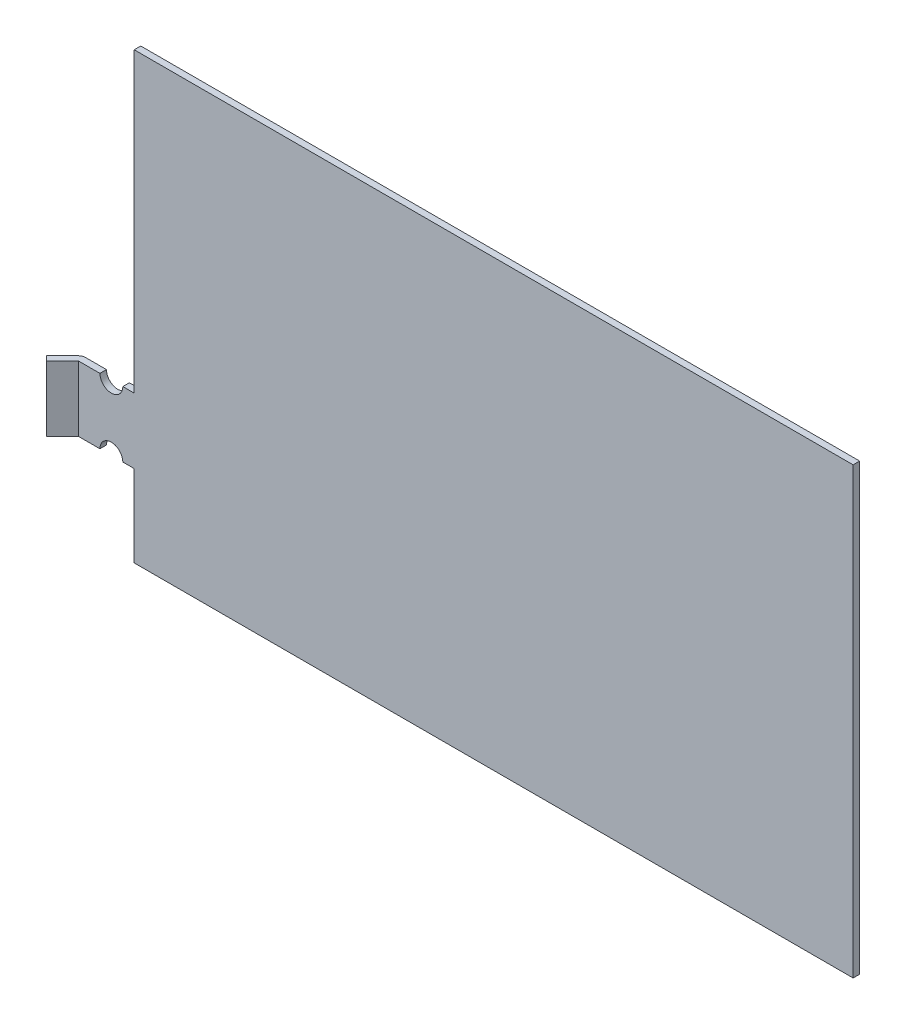
ISO-10303-21;
HEADER;
FILE_DESCRIPTION(('STEP AP214'),'2;1');
FILE_NAME('part.step','',(''),(''),'','','');
FILE_SCHEMA(('AUTOMOTIVE_DESIGN { 1 0 10303 214 1 1 1 1 }'));
ENDSEC;
DATA;
#1=APPLICATION_CONTEXT('core data for automotive mechanical design processes');
#2=APPLICATION_PROTOCOL_DEFINITION('international standard','automotive_design',2000,#1);
#3=PRODUCT_CONTEXT('',#1,'mechanical');
#4=PRODUCT('Part','Part','',(#3));
#5=PRODUCT_RELATED_PRODUCT_CATEGORY('part','',(#4));
#6=PRODUCT_DEFINITION_FORMATION('','',#4);
#7=PRODUCT_DEFINITION_CONTEXT('part definition',#1,'design');
#8=PRODUCT_DEFINITION('design','',#6,#7);
#9=PRODUCT_DEFINITION_SHAPE('','',#8);
#10=(LENGTH_UNIT() NAMED_UNIT(*) SI_UNIT(.MILLI.,.METRE.));
#11=(NAMED_UNIT(*) PLANE_ANGLE_UNIT() SI_UNIT($,.RADIAN.));
#12=(NAMED_UNIT(*) SI_UNIT($,.STERADIAN.) SOLID_ANGLE_UNIT());
#13=UNCERTAINTY_MEASURE_WITH_UNIT(LENGTH_MEASURE(1.E-05),#10,'distance_accuracy_value','');
#14=(GEOMETRIC_REPRESENTATION_CONTEXT(3) GLOBAL_UNCERTAINTY_ASSIGNED_CONTEXT((#13)) GLOBAL_UNIT_ASSIGNED_CONTEXT((#10,
#11,#12)) REPRESENTATION_CONTEXT('',''));
#15=CARTESIAN_POINT('',(0.,0.,0.));
#16=DIRECTION('',(0.,0.,1.));
#17=DIRECTION('',(1.,0.,0.));
#18=AXIS2_PLACEMENT_3D('',#15,#16,#17);
#19=CARTESIAN_POINT('',(-65.2711551112264,-15.,0.));
#20=DIRECTION('',(0.,1.,0.));
#21=DIRECTION('',(-1.,0.,0.));
#22=AXIS2_PLACEMENT_3D('',#19,#20,#21);
#23=PLANE('',#22);
#24=DIRECTION('',(0.,0.,1.));
#25=VECTOR('',#24,1.);
#26=CARTESIAN_POINT('',(-80.5,-15.,-276.873298324553));
#27=LINE('',#26,#25);
#28=CARTESIAN_POINT('',(-80.5,-15.,0.));
#29=VERTEX_POINT('',#28);
#30=CARTESIAN_POINT('',(-80.5,-15.,2.));
#31=VERTEX_POINT('',#30);
#32=EDGE_CURVE('E11',#29,#31,#27,.T.);
#33=ORIENTED_EDGE('',*,*,#32,.F.);
#34=DIRECTION('',(-1.,0.,0.));
#35=VECTOR('',#34,1.);
#36=CARTESIAN_POINT('',(-65.2711551112264,-15.,0.));
#37=LINE('',#36,#35);
#38=CARTESIAN_POINT('',(-86.9991715728753,-15.,0.));
#39=VERTEX_POINT('',#38);
#40=EDGE_CURVE('E225',#29,#39,#37,.T.);
#41=ORIENTED_EDGE('',*,*,#40,.T.);
#42=CARTESIAN_POINT('',(-86.9991715728753,-15.,2.002));
#43=DIRECTION('',(0.,1.,0.));
#44=DIRECTION('',(0.,0.,1.));
#45=AXIS2_PLACEMENT_3D('',#42,#43,#44);
#46=CIRCLE('',#45,2.002);
#47=CARTESIAN_POINT('',(-88.4147993488107,-15.,0.586372224064531));
#48=VERTEX_POINT('',#47);
#49=EDGE_CURVE('E258',#39,#48,#46,.T.);
#50=ORIENTED_EDGE('',*,*,#49,.T.);
#51=DIRECTION('',(0.707106781186548,0.,-0.707106781186548));
#52=VECTOR('',#51,1.);
#53=CARTESIAN_POINT('',(-88.2309750672444,-15.,0.40254794249823));
#54=LINE('',#53,#52);
#55=CARTESIAN_POINT('',(-93.3639610306789,-15.,5.53553390593275));
#56=VERTEX_POINT('',#55);
#57=EDGE_CURVE('E251',#56,#48,#54,.T.);
#58=ORIENTED_EDGE('',*,*,#57,.F.);
#59=DIRECTION('',(0.707106781186548,0.,0.707106781186548));
#60=VECTOR('',#59,1.);
#61=CARTESIAN_POINT('',(-93.3639610306789,-15.,5.53553390593275));
#62=LINE('',#61,#60);
#63=CARTESIAN_POINT('',(-91.9497474683059,-15.,6.94974746830585));
#64=VERTEX_POINT('',#63);
#65=EDGE_CURVE('E236',#56,#64,#62,.T.);
#66=ORIENTED_EDGE('',*,*,#65,.T.);
#67=DIRECTION('',(0.707106781186548,0.,-0.707106781186548));
#68=VECTOR('',#67,1.);
#69=CARTESIAN_POINT('',(-86.8167615048713,-15.,1.81676150487133));
#70=LINE('',#69,#68);
#71=CARTESIAN_POINT('',(-87.0005857864376,-15.,2.00058578643763));
#72=VERTEX_POINT('',#71);
#73=EDGE_CURVE('E240',#64,#72,#70,.T.);
#74=ORIENTED_EDGE('',*,*,#73,.T.);
#75=CARTESIAN_POINT('',(-86.9991715728753,-15.,2.002));
#76=DIRECTION('',(0.,-1.,0.));
#77=DIRECTION('',(0.,0.,-1.));
#78=AXIS2_PLACEMENT_3D('',#75,#76,#77);
#79=CIRCLE('',#78,0.00199999999999983);
#80=CARTESIAN_POINT('',(-86.9991715728753,-15.,2.));
#81=VERTEX_POINT('',#80);
#82=EDGE_CURVE('E261',#81,#72,#79,.F.);
#83=ORIENTED_EDGE('',*,*,#82,.F.);
#84=DIRECTION('',(-1.,0.,0.));
#85=VECTOR('',#84,1.);
#86=CARTESIAN_POINT('',(-65.2711551112264,-15.,2.));
#87=LINE('',#86,#85);
#88=EDGE_CURVE('E149',#31,#81,#87,.T.);
#89=ORIENTED_EDGE('',*,*,#88,.F.);
#90=EDGE_LOOP('',(#33,#41,#50,#58,#66,#74,#83,#89));
#91=FACE_BOUND('',#90,.T.);
#92=ADVANCED_FACE('F18',(#91),#23,.T.);
#93=CARTESIAN_POINT('',(-87.,-35.,0.));
#94=DIRECTION('',(0.,-1.,0.));
#95=DIRECTION('',(0.,0.,-1.));
#96=AXIS2_PLACEMENT_3D('',#93,#94,#95);
#97=PLANE('',#96);
#98=DIRECTION('',(0.,0.,1.));
#99=VECTOR('',#98,1.);
#100=CARTESIAN_POINT('',(-73.5,-35.,-276.873298324553));
#101=LINE('',#100,#99);
#102=CARTESIAN_POINT('',(-73.5,-35.,0.));
#103=VERTEX_POINT('',#102);
#104=CARTESIAN_POINT('',(-73.5,-35.,2.));
#105=VERTEX_POINT('',#104);
#106=EDGE_CURVE('E39',#103,#105,#101,.T.);
#107=ORIENTED_EDGE('',*,*,#106,.F.);
#108=DIRECTION('',(1.,0.,0.));
#109=VECTOR('',#108,1.);
#110=CARTESIAN_POINT('',(-87.,-35.,0.));
#111=LINE('',#110,#109);
#112=CARTESIAN_POINT('',(-70.,-35.,0.));
#113=VERTEX_POINT('',#112);
#114=EDGE_CURVE('E148',#103,#113,#111,.T.);
#115=ORIENTED_EDGE('',*,*,#114,.T.);
#116=DIRECTION('',(0.,0.,-1.));
#117=VECTOR('',#116,1.);
#118=CARTESIAN_POINT('',(-70.,-35.,2.));
#119=LINE('',#118,#117);
#120=CARTESIAN_POINT('',(-70.,-35.,2.));
#121=VERTEX_POINT('',#120);
#122=EDGE_CURVE('E164',#121,#113,#119,.T.);
#123=ORIENTED_EDGE('',*,*,#122,.F.);
#124=DIRECTION('',(1.,0.,0.));
#125=VECTOR('',#124,1.);
#126=CARTESIAN_POINT('',(-87.,-35.,2.));
#127=LINE('',#126,#125);
#128=EDGE_CURVE('E233',#105,#121,#127,.T.);
#129=ORIENTED_EDGE('',*,*,#128,.F.);
#130=EDGE_LOOP('',(#107,#115,#123,#129));
#131=FACE_BOUND('',#130,.T.);
#132=ADVANCED_FACE('F301',(#131),#97,.T.);
#133=CARTESIAN_POINT('',(-70.,76.,2.));
#134=DIRECTION('',(1.,0.,0.));
#135=DIRECTION('',(0.,1.,0.));
#136=AXIS2_PLACEMENT_3D('',#133,#134,#135);
#137=PLANE('',#136);
#138=DIRECTION('',(0.,-1.,0.));
#139=VECTOR('',#138,1.);
#140=CARTESIAN_POINT('',(-70.,76.,2.));
#141=LINE('',#140,#139);
#142=CARTESIAN_POINT('',(-70.,-60.,2.));
#143=VERTEX_POINT('',#142);
#144=EDGE_CURVE('E176',#121,#143,#141,.T.);
#145=ORIENTED_EDGE('',*,*,#144,.F.);
#146=ORIENTED_EDGE('',*,*,#122,.T.);
#147=DIRECTION('',(0.,-1.,0.));
#148=VECTOR('',#147,1.);
#149=CARTESIAN_POINT('',(-70.,76.,0.));
#150=LINE('',#149,#148);
#151=CARTESIAN_POINT('',(-70.,-60.,0.));
#152=VERTEX_POINT('',#151);
#153=EDGE_CURVE('E167',#113,#152,#150,.T.);
#154=ORIENTED_EDGE('',*,*,#153,.T.);
#155=DIRECTION('',(0.,0.,-1.));
#156=VECTOR('',#155,1.);
#157=CARTESIAN_POINT('',(-70.,-60.,2.));
#158=LINE('',#157,#156);
#159=EDGE_CURVE('E198',#143,#152,#158,.T.);
#160=ORIENTED_EDGE('',*,*,#159,.F.);
#161=EDGE_LOOP('',(#145,#146,#154,#160));
#162=FACE_BOUND('',#161,.T.);
#163=ADVANCED_FACE('F304',(#162),#137,.F.);
#164=CARTESIAN_POINT('',(-70.,76.,0.));
#165=VERTEX_POINT('',#164);
#166=CARTESIAN_POINT('',(-70.,-15.,0.));
#167=VERTEX_POINT('',#166);
#168=EDGE_CURVE('E181',#165,#167,#150,.T.);
#169=ORIENTED_EDGE('',*,*,#168,.T.);
#170=DIRECTION('',(0.,0.,1.));
#171=VECTOR('',#170,1.);
#172=CARTESIAN_POINT('',(-70.,-15.,2.));
#173=LINE('',#172,#171);
#174=CARTESIAN_POINT('',(-70.,-15.,2.));
#175=VERTEX_POINT('',#174);
#176=EDGE_CURVE('E162',#167,#175,#173,.T.);
#177=ORIENTED_EDGE('',*,*,#176,.T.);
#178=CARTESIAN_POINT('',(-70.,76.,2.));
#179=VERTEX_POINT('',#178);
#180=EDGE_CURVE('E146',#179,#175,#141,.T.);
#181=ORIENTED_EDGE('',*,*,#180,.F.);
#182=DIRECTION('',(0.,0.,-1.));
#183=VECTOR('',#182,1.);
#184=CARTESIAN_POINT('',(-70.,76.,2.));
#185=LINE('',#184,#183);
#186=EDGE_CURVE('E174',#179,#165,#185,.T.);
#187=ORIENTED_EDGE('',*,*,#186,.T.);
#188=EDGE_LOOP('',(#169,#177,#181,#187));
#189=FACE_BOUND('',#188,.T.);
#190=ADVANCED_FACE('F20',(#189),#137,.F.);
#191=CARTESIAN_POINT('',(-70.,-60.,2.));
#192=DIRECTION('',(0.,1.,0.));
#193=DIRECTION('',(0.,0.,1.));
#194=AXIS2_PLACEMENT_3D('',#191,#192,#193);
#195=PLANE('',#194);
#196=DIRECTION('',(1.,0.,0.));
#197=VECTOR('',#196,1.);
#198=CARTESIAN_POINT('',(-70.,-60.,0.));
#199=LINE('',#198,#197);
#200=CARTESIAN_POINT('',(150.,-60.,0.));
#201=VERTEX_POINT('',#200);
#202=EDGE_CURVE('E177',#152,#201,#199,.T.);
#203=ORIENTED_EDGE('',*,*,#202,.T.);
#204=DIRECTION('',(0.,0.,-1.));
#205=VECTOR('',#204,1.);
#206=CARTESIAN_POINT('',(150.,-60.,2.));
#207=LINE('',#206,#205);
#208=CARTESIAN_POINT('',(150.,-60.,2.));
#209=VERTEX_POINT('',#208);
#210=EDGE_CURVE('E195',#209,#201,#207,.T.);
#211=ORIENTED_EDGE('',*,*,#210,.F.);
#212=DIRECTION('',(1.,0.,0.));
#213=VECTOR('',#212,1.);
#214=CARTESIAN_POINT('',(-70.,-60.,2.));
#215=LINE('',#214,#213);
#216=EDGE_CURVE('E168',#143,#209,#215,.T.);
#217=ORIENTED_EDGE('',*,*,#216,.F.);
#218=ORIENTED_EDGE('',*,*,#159,.T.);
#219=EDGE_LOOP('',(#203,#211,#217,#218));
#220=FACE_BOUND('',#219,.T.);
#221=ADVANCED_FACE('F307',(#220),#195,.F.);
#222=CARTESIAN_POINT('',(150.,-60.,2.));
#223=DIRECTION('',(-1.,0.,0.));
#224=DIRECTION('',(0.,0.,1.));
#225=AXIS2_PLACEMENT_3D('',#222,#223,#224);
#226=PLANE('',#225);
#227=DIRECTION('',(0.,1.,0.));
#228=VECTOR('',#227,1.);
#229=CARTESIAN_POINT('',(150.,-60.,0.));
#230=LINE('',#229,#228);
#231=CARTESIAN_POINT('',(150.,76.,0.));
#232=VERTEX_POINT('',#231);
#233=EDGE_CURVE('E180',#201,#232,#230,.T.);
#234=ORIENTED_EDGE('',*,*,#233,.T.);
#235=DIRECTION('',(0.,0.,-1.));
#236=VECTOR('',#235,1.);
#237=CARTESIAN_POINT('',(150.,76.,2.));
#238=LINE('',#237,#236);
#239=CARTESIAN_POINT('',(150.,76.,2.));
#240=VERTEX_POINT('',#239);
#241=EDGE_CURVE('E192',#240,#232,#238,.T.);
#242=ORIENTED_EDGE('',*,*,#241,.F.);
#243=DIRECTION('',(0.,1.,0.));
#244=VECTOR('',#243,1.);
#245=CARTESIAN_POINT('',(150.,-60.,2.));
#246=LINE('',#245,#244);
#247=EDGE_CURVE('E170',#209,#240,#246,.T.);
#248=ORIENTED_EDGE('',*,*,#247,.F.);
#249=ORIENTED_EDGE('',*,*,#210,.T.);
#250=EDGE_LOOP('',(#234,#242,#248,#249));
#251=FACE_BOUND('',#250,.T.);
#252=ADVANCED_FACE('F314',(#251),#226,.F.);
#253=CARTESIAN_POINT('',(150.,76.,2.));
#254=DIRECTION('',(0.,-1.,0.));
#255=DIRECTION('',(1.,0.,0.));
#256=AXIS2_PLACEMENT_3D('',#253,#254,#255);
#257=PLANE('',#256);
#258=DIRECTION('',(-1.,0.,0.));
#259=VECTOR('',#258,1.);
#260=CARTESIAN_POINT('',(150.,76.,0.));
#261=LINE('',#260,#259);
#262=EDGE_CURVE('E184',#232,#165,#261,.T.);
#263=ORIENTED_EDGE('',*,*,#262,.T.);
#264=ORIENTED_EDGE('',*,*,#186,.F.);
#265=DIRECTION('',(-1.,0.,0.));
#266=VECTOR('',#265,1.);
#267=CARTESIAN_POINT('',(150.,76.,2.));
#268=LINE('',#267,#266);
#269=EDGE_CURVE('E172',#240,#179,#268,.T.);
#270=ORIENTED_EDGE('',*,*,#269,.F.);
#271=ORIENTED_EDGE('',*,*,#241,.T.);
#272=EDGE_LOOP('',(#263,#264,#270,#271));
#273=FACE_BOUND('',#272,.T.);
#274=ADVANCED_FACE('F318',(#273),#257,.F.);
#275=CARTESIAN_POINT('',(-70.,76.,2.));
#276=DIRECTION('',(0.,0.,-1.));
#277=DIRECTION('',(-1.,0.,0.));
#278=AXIS2_PLACEMENT_3D('',#275,#276,#277);
#279=PLANE('',#278);
#280=CARTESIAN_POINT('',(-73.5,-15.,2.));
#281=VERTEX_POINT('',#280);
#282=EDGE_CURVE('E139',#175,#281,#87,.T.);
#283=ORIENTED_EDGE('',*,*,#282,.T.);
#284=CARTESIAN_POINT('',(-77.,-15.,2.));
#285=DIRECTION('',(0.,0.,1.));
#286=DIRECTION('',(1.,0.,0.));
#287=AXIS2_PLACEMENT_3D('',#284,#285,#286);
#288=CIRCLE('',#287,3.5);
#289=EDGE_CURVE('E126',#31,#281,#288,.T.);
#290=ORIENTED_EDGE('',*,*,#289,.F.);
#291=ORIENTED_EDGE('',*,*,#88,.T.);
#292=DIRECTION('',(0.,-1.,0.));
#293=VECTOR('',#292,1.);
#294=CARTESIAN_POINT('',(-86.9991715728753,-15.,2.));
#295=LINE('',#294,#293);
#296=CARTESIAN_POINT('',(-86.9991715728753,-35.,2.));
#297=VERTEX_POINT('',#296);
#298=EDGE_CURVE('E229',#81,#297,#295,.T.);
#299=ORIENTED_EDGE('',*,*,#298,.T.);
#300=CARTESIAN_POINT('',(-80.5,-35.,2.));
#301=VERTEX_POINT('',#300);
#302=EDGE_CURVE('E158',#297,#301,#127,.T.);
#303=ORIENTED_EDGE('',*,*,#302,.T.);
#304=CARTESIAN_POINT('',(-77.,-35.,2.));
#305=DIRECTION('',(0.,0.,1.));
#306=DIRECTION('',(1.,0.,0.));
#307=AXIS2_PLACEMENT_3D('',#304,#305,#306);
#308=CIRCLE('',#307,3.5);
#309=EDGE_CURVE('E207',#105,#301,#308,.T.);
#310=ORIENTED_EDGE('',*,*,#309,.F.);
#311=ORIENTED_EDGE('',*,*,#128,.T.);
#312=ORIENTED_EDGE('',*,*,#144,.T.);
#313=ORIENTED_EDGE('',*,*,#216,.T.);
#314=ORIENTED_EDGE('',*,*,#247,.T.);
#315=ORIENTED_EDGE('',*,*,#269,.T.);
#316=ORIENTED_EDGE('',*,*,#180,.T.);
#317=EDGE_LOOP('',(#283,#290,#291,#299,#303,#310,#311,#312,#313,#314,#315,#316));
#318=FACE_BOUND('',#317,.T.);
#319=ADVANCED_FACE('F144',(#318),#279,.F.);
#320=CARTESIAN_POINT('',(-70.,76.,0.));
#321=DIRECTION('',(0.,0.,-1.));
#322=DIRECTION('',(-1.,0.,0.));
#323=AXIS2_PLACEMENT_3D('',#320,#321,#322);
#324=PLANE('',#323);
#325=CARTESIAN_POINT('',(-77.,-15.,0.));
#326=DIRECTION('',(0.,0.,-1.));
#327=DIRECTION('',(-1.,0.,0.));
#328=AXIS2_PLACEMENT_3D('',#325,#326,#327);
#329=CIRCLE('',#328,3.5);
#330=CARTESIAN_POINT('',(-73.5,-15.,0.));
#331=VERTEX_POINT('',#330);
#332=EDGE_CURVE('E134',#331,#29,#329,.T.);
#333=ORIENTED_EDGE('',*,*,#332,.F.);
#334=EDGE_CURVE('E142',#167,#331,#37,.T.);
#335=ORIENTED_EDGE('',*,*,#334,.F.);
#336=ORIENTED_EDGE('',*,*,#168,.F.);
#337=ORIENTED_EDGE('',*,*,#262,.F.);
#338=ORIENTED_EDGE('',*,*,#233,.F.);
#339=ORIENTED_EDGE('',*,*,#202,.F.);
#340=ORIENTED_EDGE('',*,*,#153,.F.);
#341=ORIENTED_EDGE('',*,*,#114,.F.);
#342=CARTESIAN_POINT('',(-77.,-35.,0.));
#343=DIRECTION('',(0.,0.,-1.));
#344=DIRECTION('',(-1.,0.,0.));
#345=AXIS2_PLACEMENT_3D('',#342,#343,#344);
#346=CIRCLE('',#345,3.5);
#347=CARTESIAN_POINT('',(-80.5,-35.,0.));
#348=VERTEX_POINT('',#347);
#349=EDGE_CURVE('E206',#348,#103,#346,.T.);
#350=ORIENTED_EDGE('',*,*,#349,.F.);
#351=CARTESIAN_POINT('',(-86.9991715728753,-35.,0.));
#352=VERTEX_POINT('',#351);
#353=EDGE_CURVE('E155',#352,#348,#111,.T.);
#354=ORIENTED_EDGE('',*,*,#353,.F.);
#355=DIRECTION('',(0.,-1.,0.));
#356=VECTOR('',#355,1.);
#357=CARTESIAN_POINT('',(-86.9991715728753,-15.,0.));
#358=LINE('',#357,#356);
#359=EDGE_CURVE('E227',#39,#352,#358,.T.);
#360=ORIENTED_EDGE('',*,*,#359,.F.);
#361=ORIENTED_EDGE('',*,*,#40,.F.);
#362=EDGE_LOOP('',(#333,#335,#336,#337,#338,#339,#340,#341,#350,#354,#360,#361));
#363=FACE_BOUND('',#362,.T.);
#364=ADVANCED_FACE('F215',(#363),#324,.T.);
#365=DIRECTION('',(0.,0.,1.));
#366=VECTOR('',#365,1.);
#367=CARTESIAN_POINT('',(-80.5,-35.,-276.873298324553));
#368=LINE('',#367,#366);
#369=EDGE_CURVE('E201',#301,#348,#368,.F.);
#370=ORIENTED_EDGE('',*,*,#369,.F.);
#371=ORIENTED_EDGE('',*,*,#302,.F.);
#372=CARTESIAN_POINT('',(-86.9991715728753,-35.,2.002));
#373=DIRECTION('',(0.,-1.,0.));
#374=DIRECTION('',(0.,0.,-1.));
#375=AXIS2_PLACEMENT_3D('',#372,#373,#374);
#376=CIRCLE('',#375,0.00199999999999983);
#377=CARTESIAN_POINT('',(-87.0005857864376,-35.,2.00058578643763));
#378=VERTEX_POINT('',#377);
#379=EDGE_CURVE('E218',#378,#297,#376,.T.);
#380=ORIENTED_EDGE('',*,*,#379,.F.);
#381=DIRECTION('',(-0.707106781186548,0.,0.707106781186548));
#382=VECTOR('',#381,1.);
#383=CARTESIAN_POINT('',(-86.8167615048713,-35.,1.81676150487133));
#384=LINE('',#383,#382);
#385=CARTESIAN_POINT('',(-91.9497474683058,-35.,6.94974746830584));
#386=VERTEX_POINT('',#385);
#387=EDGE_CURVE('E248',#378,#386,#384,.T.);
#388=ORIENTED_EDGE('',*,*,#387,.T.);
#389=DIRECTION('',(0.707106781186548,0.,0.707106781186548));
#390=VECTOR('',#389,1.);
#391=CARTESIAN_POINT('',(-93.3639610306789,-35.,5.53553390593274));
#392=LINE('',#391,#390);
#393=CARTESIAN_POINT('',(-93.3639610306789,-35.,5.53553390593274));
#394=VERTEX_POINT('',#393);
#395=EDGE_CURVE('E230',#394,#386,#392,.T.);
#396=ORIENTED_EDGE('',*,*,#395,.F.);
#397=DIRECTION('',(-0.707106781186548,0.,0.707106781186548));
#398=VECTOR('',#397,1.);
#399=CARTESIAN_POINT('',(-88.2309750672444,-35.,0.40254794249823));
#400=LINE('',#399,#398);
#401=CARTESIAN_POINT('',(-88.4147993488107,-35.,0.586372224064531));
#402=VERTEX_POINT('',#401);
#403=EDGE_CURVE('E239',#402,#394,#400,.T.);
#404=ORIENTED_EDGE('',*,*,#403,.F.);
#405=CARTESIAN_POINT('',(-86.9991715728753,-35.,2.002));
#406=DIRECTION('',(0.,-1.,0.));
#407=DIRECTION('',(0.,0.,1.));
#408=AXIS2_PLACEMENT_3D('',#405,#406,#407);
#409=CIRCLE('',#408,2.002);
#410=EDGE_CURVE('E224',#402,#352,#409,.T.);
#411=ORIENTED_EDGE('',*,*,#410,.T.);
#412=ORIENTED_EDGE('',*,*,#353,.T.);
#413=EDGE_LOOP('',(#370,#371,#380,#388,#396,#404,#411,#412));
#414=FACE_BOUND('',#413,.T.);
#415=ADVANCED_FACE('F221',(#414),#97,.T.);
#416=DIRECTION('',(0.,0.,1.));
#417=VECTOR('',#416,1.);
#418=CARTESIAN_POINT('',(-73.5,-15.,-276.873298324553));
#419=LINE('',#418,#417);
#420=EDGE_CURVE('E22',#281,#331,#419,.F.);
#421=ORIENTED_EDGE('',*,*,#420,.F.);
#422=ORIENTED_EDGE('',*,*,#282,.F.);
#423=ORIENTED_EDGE('',*,*,#176,.F.);
#424=ORIENTED_EDGE('',*,*,#334,.T.);
#425=EDGE_LOOP('',(#421,#422,#423,#424));
#426=FACE_BOUND('',#425,.T.);
#427=ADVANCED_FACE('F138',(#426),#23,.T.);
#428=CARTESIAN_POINT('',(-43.9142135623731,0.,-43.9142135623731));
#429=DIRECTION('',(-0.707106781186548,0.,-0.707106781186548));
#430=DIRECTION('',(-0.707106781186548,0.,0.707106781186548));
#431=AXIS2_PLACEMENT_3D('',#428,#429,#430);
#432=PLANE('',#431);
#433=ORIENTED_EDGE('',*,*,#57,.T.);
#434=DIRECTION('',(0.,-1.,0.));
#435=VECTOR('',#434,1.);
#436=CARTESIAN_POINT('',(-88.4147993488107,-15.,0.586372224064531));
#437=LINE('',#436,#435);
#438=EDGE_CURVE('E256',#48,#402,#437,.T.);
#439=ORIENTED_EDGE('',*,*,#438,.T.);
#440=ORIENTED_EDGE('',*,*,#403,.T.);
#441=DIRECTION('',(0.,1.,0.));
#442=VECTOR('',#441,1.);
#443=CARTESIAN_POINT('',(-93.3639610306789,-35.,5.53553390593275));
#444=LINE('',#443,#442);
#445=EDGE_CURVE('E253',#394,#56,#444,.T.);
#446=ORIENTED_EDGE('',*,*,#445,.T.);
#447=EDGE_LOOP('',(#433,#439,#440,#446));
#448=FACE_BOUND('',#447,.T.);
#449=ADVANCED_FACE('F281',(#448),#432,.T.);
#450=CARTESIAN_POINT('',(-42.5,0.,-42.5));
#451=DIRECTION('',(-0.707106781186548,0.,-0.707106781186548));
#452=DIRECTION('',(-0.707106781186548,0.,0.707106781186548));
#453=AXIS2_PLACEMENT_3D('',#450,#451,#452);
#454=PLANE('',#453);
#455=DIRECTION('',(0.,-1.,0.));
#456=VECTOR('',#455,1.);
#457=CARTESIAN_POINT('',(-87.0005857864376,-15.,2.00058578643763));
#458=LINE('',#457,#456);
#459=EDGE_CURVE('E245',#72,#378,#458,.T.);
#460=ORIENTED_EDGE('',*,*,#459,.F.);
#461=ORIENTED_EDGE('',*,*,#73,.F.);
#462=DIRECTION('',(0.,1.,0.));
#463=VECTOR('',#462,1.);
#464=CARTESIAN_POINT('',(-91.9497474683059,-35.,6.94974746830585));
#465=LINE('',#464,#463);
#466=EDGE_CURVE('E244',#386,#64,#465,.T.);
#467=ORIENTED_EDGE('',*,*,#466,.F.);
#468=ORIENTED_EDGE('',*,*,#387,.F.);
#469=EDGE_LOOP('',(#460,#461,#467,#468));
#470=FACE_BOUND('',#469,.T.);
#471=ADVANCED_FACE('F288',(#470),#454,.F.);
#472=CARTESIAN_POINT('',(-93.3639610306789,-35.,5.53553390593275));
#473=DIRECTION('',(0.707106781186548,0.,-0.707106781186548));
#474=DIRECTION('',(-0.707106781186548,0.,-0.707106781186548));
#475=AXIS2_PLACEMENT_3D('',#472,#473,#474);
#476=PLANE('',#475);
#477=ORIENTED_EDGE('',*,*,#466,.T.);
#478=ORIENTED_EDGE('',*,*,#65,.F.);
#479=ORIENTED_EDGE('',*,*,#445,.F.);
#480=ORIENTED_EDGE('',*,*,#395,.T.);
#481=EDGE_LOOP('',(#477,#478,#479,#480));
#482=FACE_BOUND('',#481,.T.);
#483=ADVANCED_FACE('F285',(#482),#476,.F.);
#484=CARTESIAN_POINT('',(-86.9991715728753,-15.,2.002));
#485=DIRECTION('',(0.,-1.,0.));
#486=DIRECTION('',(0.,0.,1.));
#487=AXIS2_PLACEMENT_3D('',#484,#485,#486);
#488=CYLINDRICAL_SURFACE('',#487,2.002);
#489=ORIENTED_EDGE('',*,*,#410,.F.);
#490=ORIENTED_EDGE('',*,*,#438,.F.);
#491=ORIENTED_EDGE('',*,*,#49,.F.);
#492=ORIENTED_EDGE('',*,*,#359,.T.);
#493=EDGE_LOOP('',(#489,#490,#491,#492));
#494=FACE_BOUND('',#493,.T.);
#495=ADVANCED_FACE('F275',(#494),#488,.T.);
#496=CARTESIAN_POINT('',(-86.9991715728753,-15.,2.002));
#497=DIRECTION('',(0.,-1.,0.));
#498=DIRECTION('',(0.,0.,1.));
#499=AXIS2_PLACEMENT_3D('',#496,#497,#498);
#500=CYLINDRICAL_SURFACE('',#499,0.00199999999999983);
#501=ORIENTED_EDGE('',*,*,#379,.T.);
#502=ORIENTED_EDGE('',*,*,#298,.F.);
#503=ORIENTED_EDGE('',*,*,#82,.T.);
#504=ORIENTED_EDGE('',*,*,#459,.T.);
#505=EDGE_LOOP('',(#501,#502,#503,#504));
#506=FACE_BOUND('',#505,.T.);
#507=ADVANCED_FACE('F292',(#506),#500,.F.);
#508=CARTESIAN_POINT('',(-77.,-35.,-276.873298324553));
#509=DIRECTION('',(0.,0.,1.));
#510=DIRECTION('',(1.,0.,0.));
#511=AXIS2_PLACEMENT_3D('',#508,#509,#510);
#512=CYLINDRICAL_SURFACE('',#511,3.5);
#513=ORIENTED_EDGE('',*,*,#106,.T.);
#514=ORIENTED_EDGE('',*,*,#309,.T.);
#515=ORIENTED_EDGE('',*,*,#369,.T.);
#516=ORIENTED_EDGE('',*,*,#349,.T.);
#517=EDGE_LOOP('',(#513,#514,#515,#516));
#518=FACE_BOUND('',#517,.T.);
#519=ADVANCED_FACE('F205',(#518),#512,.F.);
#520=CARTESIAN_POINT('',(-77.,-15.,-276.873298324553));
#521=DIRECTION('',(0.,0.,1.));
#522=DIRECTION('',(1.,0.,0.));
#523=AXIS2_PLACEMENT_3D('',#520,#521,#522);
#524=CYLINDRICAL_SURFACE('',#523,3.5);
#525=ORIENTED_EDGE('',*,*,#32,.T.);
#526=ORIENTED_EDGE('',*,*,#289,.T.);
#527=ORIENTED_EDGE('',*,*,#420,.T.);
#528=ORIENTED_EDGE('',*,*,#332,.T.);
#529=EDGE_LOOP('',(#525,#526,#527,#528));
#530=FACE_BOUND('',#529,.T.);
#531=ADVANCED_FACE('F128',(#530),#524,.F.);
#532=CLOSED_SHELL('',(#92,#132,#163,#190,#221,#252,#274,#319,#364,#415,#427,#449,#471,#483,#495,
#507,#519,#531));
#533=MANIFOLD_SOLID_BREP('B1',#532);
#534=ADVANCED_BREP_SHAPE_REPRESENTATION('',(#18,#533),#14);
#535=SHAPE_DEFINITION_REPRESENTATION(#9,#534);
ENDSEC;
END-ISO-10303-21;
